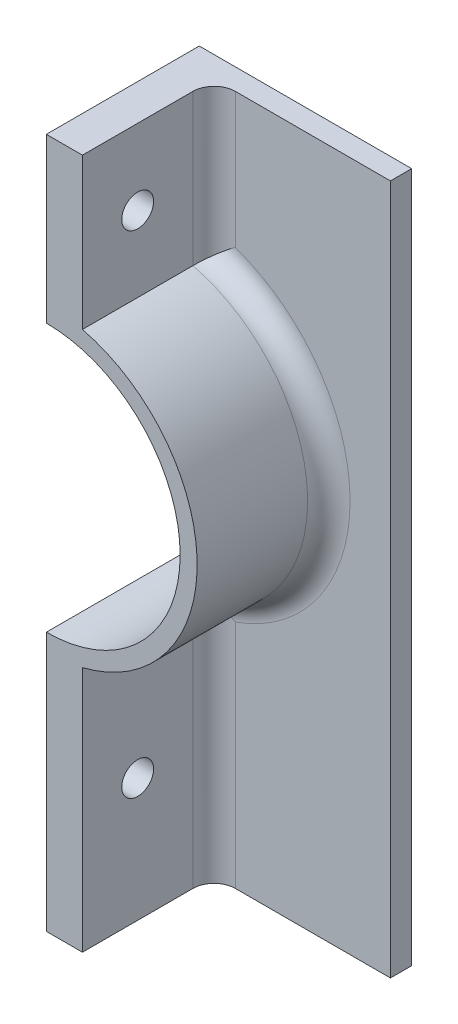
ISO-10303-21;
HEADER;
FILE_DESCRIPTION(('STEP AP214'),'2;1');
FILE_NAME('part.step','',(''),(''),'','','');
FILE_SCHEMA(('AUTOMOTIVE_DESIGN { 1 0 10303 214 1 1 1 1 }'));
ENDSEC;
DATA;
#1=APPLICATION_CONTEXT('core data for automotive mechanical design processes');
#2=APPLICATION_PROTOCOL_DEFINITION('international standard','automotive_design',2000,#1);
#3=PRODUCT_CONTEXT('',#1,'mechanical');
#4=PRODUCT('Part','Part','',(#3));
#5=PRODUCT_RELATED_PRODUCT_CATEGORY('part','',(#4));
#6=PRODUCT_DEFINITION_FORMATION('','',#4);
#7=PRODUCT_DEFINITION_CONTEXT('part definition',#1,'design');
#8=PRODUCT_DEFINITION('design','',#6,#7);
#9=PRODUCT_DEFINITION_SHAPE('','',#8);
#10=(LENGTH_UNIT() NAMED_UNIT(*) SI_UNIT(.MILLI.,.METRE.));
#11=(NAMED_UNIT(*) PLANE_ANGLE_UNIT() SI_UNIT($,.RADIAN.));
#12=(NAMED_UNIT(*) SI_UNIT($,.STERADIAN.) SOLID_ANGLE_UNIT());
#13=UNCERTAINTY_MEASURE_WITH_UNIT(LENGTH_MEASURE(1.E-05),#10,'distance_accuracy_value','');
#14=(GEOMETRIC_REPRESENTATION_CONTEXT(3) GLOBAL_UNCERTAINTY_ASSIGNED_CONTEXT((#13)) GLOBAL_UNIT_ASSIGNED_CONTEXT((#10,
#11,#12)) REPRESENTATION_CONTEXT('',''));
#15=CARTESIAN_POINT('',(0.,0.,0.));
#16=DIRECTION('',(0.,0.,1.));
#17=DIRECTION('',(1.,0.,0.));
#18=AXIS2_PLACEMENT_3D('',#15,#16,#17);
#19=CARTESIAN_POINT('',(29.718,0.,18.288));
#20=DIRECTION('',(-1.,0.,0.));
#21=DIRECTION('',(0.,0.,1.));
#22=AXIS2_PLACEMENT_3D('',#19,#20,#21);
#23=PLANE('',#22);
#24=CARTESIAN_POINT('',(29.718,14.740286526676,11.684));
#25=DIRECTION('',(-1.,0.,0.));
#26=DIRECTION('',(0.,0.,1.));
#27=AXIS2_PLACEMENT_3D('',#24,#25,#26);
#28=CIRCLE('',#27,1.905);
#29=CARTESIAN_POINT('',(29.718,14.740286526676,13.589));
#30=VERTEX_POINT('',#29);
#31=EDGE_CURVE('E253',#30,#30,#28,.F.);
#32=ORIENTED_EDGE('',*,*,#31,.F.);
#33=EDGE_LOOP('',(#32));
#34=FACE_BOUND('',#33,.T.);
#35=DIRECTION('',(0.,0.,-1.));
#36=VECTOR('',#35,1.);
#37=CARTESIAN_POINT('',(29.718,0.,18.288));
#38=LINE('',#37,#36);
#39=CARTESIAN_POINT('',(29.718,0.,18.288));
#40=VERTEX_POINT('',#39);
#41=CARTESIAN_POINT('',(29.718,0.,5.08));
#42=VERTEX_POINT('',#41);
#43=EDGE_CURVE('E210',#40,#42,#38,.T.);
#44=ORIENTED_EDGE('',*,*,#43,.T.);
#45=DIRECTION('',(0.,1.,0.));
#46=VECTOR('',#45,1.);
#47=CARTESIAN_POINT('',(29.718,0.,5.08));
#48=LINE('',#47,#46);
#49=CARTESIAN_POINT('',(29.718,29.4805730533521,5.08));
#50=VERTEX_POINT('',#49);
#51=EDGE_CURVE('E248',#42,#50,#48,.T.);
#52=ORIENTED_EDGE('',*,*,#51,.T.);
#53=DIRECTION('',(0.,0.,-1.));
#54=VECTOR('',#53,1.);
#55=CARTESIAN_POINT('',(29.718,29.4805730533521,18.288));
#56=LINE('',#55,#54);
#57=CARTESIAN_POINT('',(29.718,29.4805730533521,18.288));
#58=VERTEX_POINT('',#57);
#59=EDGE_CURVE('E245',#58,#50,#56,.T.);
#60=ORIENTED_EDGE('',*,*,#59,.F.);
#61=DIRECTION('',(0.,1.,0.));
#62=VECTOR('',#61,1.);
#63=CARTESIAN_POINT('',(29.718,0.,18.288));
#64=LINE('',#63,#62);
#65=EDGE_CURVE('E183',#40,#58,#64,.T.);
#66=ORIENTED_EDGE('',*,*,#65,.F.);
#67=EDGE_LOOP('',(#44,#52,#60,#66));
#68=FACE_BOUND('',#67,.T.);
#69=ADVANCED_FACE('F45',(#34,#68),#23,.F.);
#70=CARTESIAN_POINT('',(25.4,46.99,18.288));
#71=DIRECTION('',(0.,0.,-1.));
#72=DIRECTION('',(-1.,0.,0.));
#73=AXIS2_PLACEMENT_3D('',#70,#71,#72);
#74=CYLINDRICAL_SURFACE('',#73,18.034);
#75=ORIENTED_EDGE('',*,*,#59,.T.);
#76=CARTESIAN_POINT('',(25.4,46.99,5.08));
#77=DIRECTION('',(0.,0.,1.));
#78=DIRECTION('',(1.,0.,0.));
#79=AXIS2_PLACEMENT_3D('',#76,#77,#78);
#80=CIRCLE('',#79,18.034);
#81=CARTESIAN_POINT('',(29.718,64.4994269466479,5.08));
#82=VERTEX_POINT('',#81);
#83=EDGE_CURVE('E76',#50,#82,#80,.T.);
#84=ORIENTED_EDGE('',*,*,#83,.T.);
#85=DIRECTION('',(0.,0.,-1.));
#86=VECTOR('',#85,1.);
#87=CARTESIAN_POINT('',(29.718,64.4994269466479,18.288));
#88=LINE('',#87,#86);
#89=CARTESIAN_POINT('',(29.718,64.4994269466479,18.288));
#90=VERTEX_POINT('',#89);
#91=EDGE_CURVE('E242',#90,#82,#88,.T.);
#92=ORIENTED_EDGE('',*,*,#91,.F.);
#93=CARTESIAN_POINT('',(25.4,46.99,18.288));
#94=DIRECTION('',(0.,0.,1.));
#95=DIRECTION('',(1.,0.,0.));
#96=AXIS2_PLACEMENT_3D('',#93,#94,#95);
#97=CIRCLE('',#96,18.034);
#98=EDGE_CURVE('E187',#58,#90,#97,.T.);
#99=ORIENTED_EDGE('',*,*,#98,.F.);
#100=EDGE_LOOP('',(#75,#84,#92,#99));
#101=FACE_BOUND('',#100,.T.);
#102=ADVANCED_FACE('F298',(#101),#74,.T.);
#103=CARTESIAN_POINT('',(29.718,0.,18.288));
#104=DIRECTION('',(1.,0.,0.));
#105=DIRECTION('',(0.,0.,-1.));
#106=AXIS2_PLACEMENT_3D('',#103,#104,#105);
#107=PLANE('',#106);
#108=CARTESIAN_POINT('',(29.718,73.524713473324,11.684));
#109=DIRECTION('',(1.,0.,0.));
#110=DIRECTION('',(0.,0.,-1.));
#111=AXIS2_PLACEMENT_3D('',#108,#109,#110);
#112=CIRCLE('',#111,1.905);
#113=CARTESIAN_POINT('',(29.718,73.524713473324,9.779));
#114=VERTEX_POINT('',#113);
#115=EDGE_CURVE('E180',#114,#114,#112,.F.);
#116=ORIENTED_EDGE('',*,*,#115,.T.);
#117=EDGE_LOOP('',(#116));
#118=FACE_BOUND('',#117,.T.);
#119=ORIENTED_EDGE('',*,*,#91,.T.);
#120=DIRECTION('',(0.,-1.,0.));
#121=VECTOR('',#120,1.);
#122=CARTESIAN_POINT('',(29.718,82.55,5.08));
#123=LINE('',#122,#121);
#124=CARTESIAN_POINT('',(29.718,82.55,5.08));
#125=VERTEX_POINT('',#124);
#126=EDGE_CURVE('E68',#82,#125,#123,.F.);
#127=ORIENTED_EDGE('',*,*,#126,.T.);
#128=DIRECTION('',(0.,0.,-1.));
#129=VECTOR('',#128,1.);
#130=CARTESIAN_POINT('',(29.718,82.55,18.288));
#131=LINE('',#130,#129);
#132=CARTESIAN_POINT('',(29.718,82.55,18.288));
#133=VERTEX_POINT('',#132);
#134=EDGE_CURVE('E239',#133,#125,#131,.T.);
#135=ORIENTED_EDGE('',*,*,#134,.F.);
#136=DIRECTION('',(0.,-1.,0.));
#137=VECTOR('',#136,1.);
#138=CARTESIAN_POINT('',(29.718,0.,18.288));
#139=LINE('',#138,#137);
#140=EDGE_CURVE('E190',#133,#90,#139,.T.);
#141=ORIENTED_EDGE('',*,*,#140,.T.);
#142=EDGE_LOOP('',(#119,#127,#135,#141));
#143=FACE_BOUND('',#142,.T.);
#144=ADVANCED_FACE('F303',(#118,#143),#107,.T.);
#145=CARTESIAN_POINT('',(0.,82.55,18.288));
#146=DIRECTION('',(0.,1.,0.));
#147=DIRECTION('',(0.,0.,1.));
#148=AXIS2_PLACEMENT_3D('',#145,#146,#147);
#149=PLANE('',#148);
#150=DIRECTION('',(1.,0.,0.));
#151=VECTOR('',#150,1.);
#152=CARTESIAN_POINT('',(0.,82.55,0.));
#153=LINE('',#152,#151);
#154=CARTESIAN_POINT('',(25.4,82.55,0.));
#155=VERTEX_POINT('',#154);
#156=CARTESIAN_POINT('',(50.8,82.55,0.));
#157=VERTEX_POINT('',#156);
#158=EDGE_CURVE('E155',#155,#157,#153,.T.);
#159=ORIENTED_EDGE('',*,*,#158,.F.);
#160=DIRECTION('',(0.,0.,-1.));
#161=VECTOR('',#160,1.);
#162=CARTESIAN_POINT('',(25.4,82.55,18.288));
#163=LINE('',#162,#161);
#164=CARTESIAN_POINT('',(25.4,82.55,18.288));
#165=VERTEX_POINT('',#164);
#166=EDGE_CURVE('E236',#165,#155,#163,.T.);
#167=ORIENTED_EDGE('',*,*,#166,.F.);
#168=DIRECTION('',(1.,0.,0.));
#169=VECTOR('',#168,1.);
#170=CARTESIAN_POINT('',(0.,82.55,18.288));
#171=LINE('',#170,#169);
#172=EDGE_CURVE('E194',#165,#133,#171,.T.);
#173=ORIENTED_EDGE('',*,*,#172,.T.);
#174=ORIENTED_EDGE('',*,*,#134,.T.);
#175=CARTESIAN_POINT('',(32.258,82.55,5.08));
#176=DIRECTION('',(0.,1.,0.));
#177=DIRECTION('',(0.,0.,1.));
#178=AXIS2_PLACEMENT_3D('',#175,#176,#177);
#179=CIRCLE('',#178,2.54);
#180=CARTESIAN_POINT('',(32.258,82.55,2.54));
#181=VERTEX_POINT('',#180);
#182=EDGE_CURVE('E11',#125,#181,#179,.F.);
#183=ORIENTED_EDGE('',*,*,#182,.T.);
#184=DIRECTION('',(1.,0.,0.));
#185=VECTOR('',#184,1.);
#186=CARTESIAN_POINT('',(0.,82.55,2.54));
#187=LINE('',#186,#185);
#188=CARTESIAN_POINT('',(50.8,82.55,2.54));
#189=VERTEX_POINT('',#188);
#190=EDGE_CURVE('E172',#181,#189,#187,.T.);
#191=ORIENTED_EDGE('',*,*,#190,.T.);
#192=DIRECTION('',(0.,0.,-1.));
#193=VECTOR('',#192,1.);
#194=CARTESIAN_POINT('',(50.8,82.55,2.54));
#195=LINE('',#194,#193);
#196=EDGE_CURVE('E156',#189,#157,#195,.T.);
#197=ORIENTED_EDGE('',*,*,#196,.T.);
#198=EDGE_LOOP('',(#159,#167,#173,#174,#183,#191,#197));
#199=FACE_BOUND('',#198,.T.);
#200=ADVANCED_FACE('F310',(#199),#149,.T.);
#201=CARTESIAN_POINT('',(25.4,0.,18.288));
#202=DIRECTION('',(1.,0.,0.));
#203=DIRECTION('',(0.,0.,-1.));
#204=AXIS2_PLACEMENT_3D('',#201,#202,#203);
#205=PLANE('',#204);
#206=CARTESIAN_POINT('',(25.4,73.524713473324,11.684));
#207=DIRECTION('',(1.,0.,0.));
#208=DIRECTION('',(0.,0.,-1.));
#209=AXIS2_PLACEMENT_3D('',#206,#207,#208);
#210=CIRCLE('',#209,1.905);
#211=CARTESIAN_POINT('',(25.4,73.524713473324,9.779));
#212=VERTEX_POINT('',#211);
#213=EDGE_CURVE('E254',#212,#212,#210,.F.);
#214=ORIENTED_EDGE('',*,*,#213,.F.);
#215=EDGE_LOOP('',(#214));
#216=FACE_BOUND('',#215,.T.);
#217=DIRECTION('',(0.,-1.,0.));
#218=VECTOR('',#217,1.);
#219=CARTESIAN_POINT('',(25.4,0.,0.));
#220=LINE('',#219,#218);
#221=CARTESIAN_POINT('',(25.4,62.992,0.));
#222=VERTEX_POINT('',#221);
#223=EDGE_CURVE('E213',#155,#222,#220,.T.);
#224=ORIENTED_EDGE('',*,*,#223,.T.);
#225=DIRECTION('',(0.,0.,-1.));
#226=VECTOR('',#225,1.);
#227=CARTESIAN_POINT('',(25.4,62.992,18.288));
#228=LINE('',#227,#226);
#229=CARTESIAN_POINT('',(25.4,62.992,18.288));
#230=VERTEX_POINT('',#229);
#231=EDGE_CURVE('E233',#230,#222,#228,.T.);
#232=ORIENTED_EDGE('',*,*,#231,.F.);
#233=DIRECTION('',(0.,-1.,0.));
#234=VECTOR('',#233,1.);
#235=CARTESIAN_POINT('',(25.4,0.,18.288));
#236=LINE('',#235,#234);
#237=EDGE_CURVE('E198',#165,#230,#236,.T.);
#238=ORIENTED_EDGE('',*,*,#237,.F.);
#239=ORIENTED_EDGE('',*,*,#166,.T.);
#240=EDGE_LOOP('',(#224,#232,#238,#239));
#241=FACE_BOUND('',#240,.T.);
#242=ADVANCED_FACE('F314',(#216,#241),#205,.F.);
#243=CARTESIAN_POINT('',(25.4,46.99,18.288));
#244=DIRECTION('',(0.,0.,-1.));
#245=DIRECTION('',(-1.,0.,0.));
#246=AXIS2_PLACEMENT_3D('',#243,#244,#245);
#247=CYLINDRICAL_SURFACE('',#246,16.002);
#248=CARTESIAN_POINT('',(25.4,46.99,0.));
#249=DIRECTION('',(0.,0.,1.));
#250=DIRECTION('',(1.,0.,0.));
#251=AXIS2_PLACEMENT_3D('',#248,#249,#250);
#252=CIRCLE('',#251,16.002);
#253=CARTESIAN_POINT('',(25.4,30.988,0.));
#254=VERTEX_POINT('',#253);
#255=EDGE_CURVE('E217',#254,#222,#252,.T.);
#256=ORIENTED_EDGE('',*,*,#255,.F.);
#257=DIRECTION('',(0.,0.,-1.));
#258=VECTOR('',#257,1.);
#259=CARTESIAN_POINT('',(25.4,30.988,18.288));
#260=LINE('',#259,#258);
#261=CARTESIAN_POINT('',(25.4,30.988,18.288));
#262=VERTEX_POINT('',#261);
#263=EDGE_CURVE('E230',#262,#254,#260,.T.);
#264=ORIENTED_EDGE('',*,*,#263,.F.);
#265=CARTESIAN_POINT('',(25.4,46.99,18.288));
#266=DIRECTION('',(0.,0.,1.));
#267=DIRECTION('',(1.,0.,0.));
#268=AXIS2_PLACEMENT_3D('',#265,#266,#267);
#269=CIRCLE('',#268,16.002);
#270=EDGE_CURVE('E201',#262,#230,#269,.T.);
#271=ORIENTED_EDGE('',*,*,#270,.T.);
#272=ORIENTED_EDGE('',*,*,#231,.T.);
#273=EDGE_LOOP('',(#256,#264,#271,#272));
#274=FACE_BOUND('',#273,.T.);
#275=ADVANCED_FACE('F316',(#274),#247,.F.);
#276=CARTESIAN_POINT('',(25.4,14.740286526676,11.684));
#277=DIRECTION('',(1.,0.,0.));
#278=DIRECTION('',(0.,0.,-1.));
#279=AXIS2_PLACEMENT_3D('',#276,#277,#278);
#280=CIRCLE('',#279,1.905);
#281=CARTESIAN_POINT('',(25.4,14.740286526676,9.779));
#282=VERTEX_POINT('',#281);
#283=EDGE_CURVE('E249',#282,#282,#280,.F.);
#284=ORIENTED_EDGE('',*,*,#283,.F.);
#285=EDGE_LOOP('',(#284));
#286=FACE_BOUND('',#285,.T.);
#287=CARTESIAN_POINT('',(25.4,0.,0.));
#288=VERTEX_POINT('',#287);
#289=EDGE_CURVE('E218',#254,#288,#220,.T.);
#290=ORIENTED_EDGE('',*,*,#289,.T.);
#291=DIRECTION('',(0.,0.,-1.));
#292=VECTOR('',#291,1.);
#293=CARTESIAN_POINT('',(25.4,0.,18.288));
#294=LINE('',#293,#292);
#295=CARTESIAN_POINT('',(25.4,0.,18.288));
#296=VERTEX_POINT('',#295);
#297=EDGE_CURVE('E227',#296,#288,#294,.T.);
#298=ORIENTED_EDGE('',*,*,#297,.F.);
#299=EDGE_CURVE('E202',#262,#296,#236,.T.);
#300=ORIENTED_EDGE('',*,*,#299,.F.);
#301=ORIENTED_EDGE('',*,*,#263,.T.);
#302=EDGE_LOOP('',(#290,#298,#300,#301));
#303=FACE_BOUND('',#302,.T.);
#304=ADVANCED_FACE('F319',(#286,#303),#205,.F.);
#305=CARTESIAN_POINT('',(0.,0.,18.288));
#306=DIRECTION('',(0.,-1.,0.));
#307=DIRECTION('',(0.,0.,-1.));
#308=AXIS2_PLACEMENT_3D('',#305,#306,#307);
#309=PLANE('',#308);
#310=DIRECTION('',(-1.,0.,0.));
#311=VECTOR('',#310,1.);
#312=CARTESIAN_POINT('',(0.,0.,0.));
#313=LINE('',#312,#311);
#314=CARTESIAN_POINT('',(50.8,0.,0.));
#315=VERTEX_POINT('',#314);
#316=EDGE_CURVE('E149',#315,#288,#313,.T.);
#317=ORIENTED_EDGE('',*,*,#316,.F.);
#318=DIRECTION('',(0.,0.,-1.));
#319=VECTOR('',#318,1.);
#320=CARTESIAN_POINT('',(50.8,0.,2.54));
#321=LINE('',#320,#319);
#322=CARTESIAN_POINT('',(50.8,0.,2.54));
#323=VERTEX_POINT('',#322);
#324=EDGE_CURVE('E143',#323,#315,#321,.T.);
#325=ORIENTED_EDGE('',*,*,#324,.F.);
#326=DIRECTION('',(-1.,0.,0.));
#327=VECTOR('',#326,1.);
#328=CARTESIAN_POINT('',(0.,0.,2.54));
#329=LINE('',#328,#327);
#330=CARTESIAN_POINT('',(32.258,0.,2.54));
#331=VERTEX_POINT('',#330);
#332=EDGE_CURVE('E146',#323,#331,#329,.T.);
#333=ORIENTED_EDGE('',*,*,#332,.T.);
#334=CARTESIAN_POINT('',(32.258,0.,5.08));
#335=DIRECTION('',(0.,-1.,0.));
#336=DIRECTION('',(0.,0.,-1.));
#337=AXIS2_PLACEMENT_3D('',#334,#335,#336);
#338=CIRCLE('',#337,2.54);
#339=EDGE_CURVE('E60',#331,#42,#338,.F.);
#340=ORIENTED_EDGE('',*,*,#339,.T.);
#341=ORIENTED_EDGE('',*,*,#43,.F.);
#342=DIRECTION('',(-1.,0.,0.));
#343=VECTOR('',#342,1.);
#344=CARTESIAN_POINT('',(0.,0.,18.288));
#345=LINE('',#344,#343);
#346=EDGE_CURVE('E206',#40,#296,#345,.T.);
#347=ORIENTED_EDGE('',*,*,#346,.T.);
#348=ORIENTED_EDGE('',*,*,#297,.T.);
#349=EDGE_LOOP('',(#317,#325,#333,#340,#341,#347,#348));
#350=FACE_BOUND('',#349,.T.);
#351=ADVANCED_FACE('F145',(#350),#309,.T.);
#352=CARTESIAN_POINT('',(0.,0.,18.288));
#353=DIRECTION('',(0.,0.,1.));
#354=DIRECTION('',(1.,0.,0.));
#355=AXIS2_PLACEMENT_3D('',#352,#353,#354);
#356=PLANE('',#355);
#357=ORIENTED_EDGE('',*,*,#65,.T.);
#358=ORIENTED_EDGE('',*,*,#98,.T.);
#359=ORIENTED_EDGE('',*,*,#140,.F.);
#360=ORIENTED_EDGE('',*,*,#172,.F.);
#361=ORIENTED_EDGE('',*,*,#237,.T.);
#362=ORIENTED_EDGE('',*,*,#270,.F.);
#363=ORIENTED_EDGE('',*,*,#299,.T.);
#364=ORIENTED_EDGE('',*,*,#346,.F.);
#365=EDGE_LOOP('',(#357,#358,#359,#360,#361,#362,#363,#364));
#366=FACE_BOUND('',#365,.T.);
#367=ADVANCED_FACE('F326',(#366),#356,.T.);
#368=CARTESIAN_POINT('',(0.,0.,0.));
#369=DIRECTION('',(0.,0.,1.));
#370=DIRECTION('',(1.,0.,0.));
#371=AXIS2_PLACEMENT_3D('',#368,#369,#370);
#372=PLANE('',#371);
#373=DIRECTION('',(0.,-1.,0.));
#374=VECTOR('',#373,1.);
#375=CARTESIAN_POINT('',(50.8,0.,0.));
#376=LINE('',#375,#374);
#377=EDGE_CURVE('E166',#157,#315,#376,.T.);
#378=ORIENTED_EDGE('',*,*,#377,.T.);
#379=ORIENTED_EDGE('',*,*,#316,.T.);
#380=ORIENTED_EDGE('',*,*,#289,.F.);
#381=ORIENTED_EDGE('',*,*,#255,.T.);
#382=ORIENTED_EDGE('',*,*,#223,.F.);
#383=ORIENTED_EDGE('',*,*,#158,.T.);
#384=EDGE_LOOP('',(#378,#379,#380,#381,#382,#383));
#385=FACE_BOUND('',#384,.T.);
#386=ADVANCED_FACE('F327',(#385),#372,.F.);
#387=CARTESIAN_POINT('',(50.8,0.,2.54));
#388=DIRECTION('',(1.,0.,0.));
#389=DIRECTION('',(0.,0.,-1.));
#390=AXIS2_PLACEMENT_3D('',#387,#388,#389);
#391=PLANE('',#390);
#392=ORIENTED_EDGE('',*,*,#377,.F.);
#393=ORIENTED_EDGE('',*,*,#196,.F.);
#394=DIRECTION('',(0.,-1.,0.));
#395=VECTOR('',#394,1.);
#396=CARTESIAN_POINT('',(50.8,0.,2.54));
#397=LINE('',#396,#395);
#398=EDGE_CURVE('E162',#189,#323,#397,.T.);
#399=ORIENTED_EDGE('',*,*,#398,.T.);
#400=ORIENTED_EDGE('',*,*,#324,.T.);
#401=EDGE_LOOP('',(#392,#393,#399,#400));
#402=FACE_BOUND('',#401,.T.);
#403=ADVANCED_FACE('F169',(#402),#391,.T.);
#404=CARTESIAN_POINT('',(0.,0.,2.54));
#405=DIRECTION('',(0.,0.,1.));
#406=DIRECTION('',(1.,0.,0.));
#407=AXIS2_PLACEMENT_3D('',#404,#405,#406);
#408=PLANE('',#407);
#409=CARTESIAN_POINT('',(25.4,46.99,2.54));
#410=DIRECTION('',(0.,0.,1.));
#411=DIRECTION('',(1.,0.,0.));
#412=AXIS2_PLACEMENT_3D('',#409,#410,#411);
#413=CIRCLE('',#412,20.574);
#414=CARTESIAN_POINT('',(32.258,66.3873532215094,2.54));
#415=VERTEX_POINT('',#414);
#416=CARTESIAN_POINT('',(32.258,27.5926467784906,2.54));
#417=VERTEX_POINT('',#416);
#418=EDGE_CURVE('E264',#415,#417,#413,.F.);
#419=ORIENTED_EDGE('',*,*,#418,.T.);
#420=DIRECTION('',(0.,1.,0.));
#421=VECTOR('',#420,1.);
#422=CARTESIAN_POINT('',(32.258,0.,2.54));
#423=LINE('',#422,#421);
#424=EDGE_CURVE('E164',#417,#331,#423,.F.);
#425=ORIENTED_EDGE('',*,*,#424,.T.);
#426=ORIENTED_EDGE('',*,*,#332,.F.);
#427=ORIENTED_EDGE('',*,*,#398,.F.);
#428=ORIENTED_EDGE('',*,*,#190,.F.);
#429=DIRECTION('',(0.,-1.,0.));
#430=VECTOR('',#429,1.);
#431=CARTESIAN_POINT('',(32.258,64.4994269466479,2.54));
#432=LINE('',#431,#430);
#433=EDGE_CURVE('E261',#181,#415,#432,.T.);
#434=ORIENTED_EDGE('',*,*,#433,.T.);
#435=EDGE_LOOP('',(#419,#425,#426,#427,#428,#434));
#436=FACE_BOUND('',#435,.T.);
#437=ADVANCED_FACE('F160',(#436),#408,.T.);
#438=CARTESIAN_POINT('',(50.8,14.740286526676,11.684));
#439=DIRECTION('',(-1.,0.,0.));
#440=DIRECTION('',(0.,0.,1.));
#441=AXIS2_PLACEMENT_3D('',#438,#439,#440);
#442=CYLINDRICAL_SURFACE('',#441,1.905);
#443=ORIENTED_EDGE('',*,*,#283,.T.);
#444=EDGE_LOOP('',(#443));
#445=FACE_BOUND('',#444,.T.);
#446=ORIENTED_EDGE('',*,*,#31,.T.);
#447=EDGE_LOOP('',(#446));
#448=FACE_BOUND('',#447,.T.);
#449=ADVANCED_FACE('F338',(#445,#448),#442,.F.);
#450=CARTESIAN_POINT('',(50.8,73.524713473324,11.684));
#451=DIRECTION('',(-1.,0.,0.));
#452=DIRECTION('',(0.,0.,1.));
#453=AXIS2_PLACEMENT_3D('',#450,#451,#452);
#454=CYLINDRICAL_SURFACE('',#453,1.905);
#455=ORIENTED_EDGE('',*,*,#115,.F.);
#456=EDGE_LOOP('',(#455));
#457=FACE_BOUND('',#456,.T.);
#458=ORIENTED_EDGE('',*,*,#213,.T.);
#459=EDGE_LOOP('',(#458));
#460=FACE_BOUND('',#459,.T.);
#461=ADVANCED_FACE('F294',(#457,#460),#454,.F.);
#462=CARTESIAN_POINT('',(32.258,0.,5.08));
#463=DIRECTION('',(0.,1.,0.));
#464=DIRECTION('',(0.,0.,1.));
#465=AXIS2_PLACEMENT_3D('',#462,#463,#464);
#466=CYLINDRICAL_SURFACE('',#465,2.54);
#467=ORIENTED_EDGE('',*,*,#182,.F.);
#468=ORIENTED_EDGE('',*,*,#126,.F.);
#469=CARTESIAN_POINT('',(29.718,64.4994269466479,5.08));
#470=CARTESIAN_POINT('',(29.7179870755534,64.4994157868668,5.01902551348322));
#471=CARTESIAN_POINT('',(29.7201951885986,64.5011465240293,4.95805992742463));
#472=CARTESIAN_POINT('',(29.7289541236328,64.508006361398,4.83666739547746));
#473=CARTESIAN_POINT('',(29.7355024980739,64.513133546288,4.77624016545285));
#474=CARTESIAN_POINT('',(29.7527874036788,64.5266576853577,4.65675827025605));
#475=CARTESIAN_POINT('',(29.7634969105378,64.5350335405743,4.59769730252414));
#476=CARTESIAN_POINT('',(29.7889195344425,64.5548966763871,4.48098947118643));
#477=CARTESIAN_POINT('',(29.8036330200888,64.5663842434425,4.42334273830592));
#478=CARTESIAN_POINT('',(29.8533973376784,64.6051901368569,4.25333605531588));
#479=CARTESIAN_POINT('',(29.8941236579594,64.6368922369605,4.14356420590233));
#480=CARTESIAN_POINT('',(29.988626935846,64.7101920725611,3.93331311585028));
#481=CARTESIAN_POINT('',(30.0424234212943,64.7518046131729,3.83284809350339));
#482=CARTESIAN_POINT('',(30.1655358747617,64.8466304258917,3.63507801502231));
#483=CARTESIAN_POINT('',(30.2357399147279,64.9004988597566,3.53864359460705));
#484=CARTESIAN_POINT('',(30.3862683397798,65.0154063730678,3.3589603077969));
#485=CARTESIAN_POINT('',(30.4665947442465,65.0764468831567,3.275714079907));
#486=CARTESIAN_POINT('',(30.6525583713823,65.2169776965002,3.10693595357619));
#487=CARTESIAN_POINT('',(30.7600115098867,65.297687496294,3.02442169966884));
#488=CARTESIAN_POINT('',(30.9836384340724,65.4644689736679,2.87876314977381));
#489=CARTESIAN_POINT('',(31.0998228806023,65.5505471834883,2.81564302827231));
#490=CARTESIAN_POINT('',(31.3620316839482,65.7434034027618,2.69811570634428));
#491=CARTESIAN_POINT('',(31.5094088340701,65.8509048541518,2.64790950507683));
#492=CARTESIAN_POINT('',(31.8092299008624,66.067693164032,2.57521636921352));
#493=CARTESIAN_POINT('',(31.9616646544673,66.1769766288619,2.55268184558765));
#494=CARTESIAN_POINT('',(32.1597134083756,66.3177556544249,2.54150524908516));
#495=CARTESIAN_POINT('',(32.2045984735808,66.3495819070552,2.54016401882533));
#496=CARTESIAN_POINT('',(32.252349485532,66.3833573949703,2.54000471614421));
#497=CARTESIAN_POINT('',(32.2551746652366,66.3853554072994,2.54000000228932));
#498=CARTESIAN_POINT('',(32.258,66.3873532215094,2.54));
#499=B_SPLINE_CURVE_WITH_KNOTS('',3,(#469,#470,#471,#472,#473,#474,#475,#476,#477,#478,#479,
#480,#481,#482,#483,#484,#485,#486,#487,#488,#489,#490,#491,#492,#493,#494,#495,#496,#497,#498),
.UNSPECIFIED.,.F.,.F.,(4,2,2,2,2,2,2,2,2,2,2,2,2,2,4),(0.,0.182844331911326,0.365585642388308,
0.547159466912742,0.728750012516879,1.0908900357854,1.45357448817017,1.84479641774465,
2.23609651883415,2.70746288858523,3.17941444770126,3.74483032909133,4.30927245496242,
4.47435907852635,4.48473998763802),.UNSPECIFIED.);
#500=EDGE_CURVE('E50',#415,#82,#499,.F.);
#501=ORIENTED_EDGE('',*,*,#500,.F.);
#502=ORIENTED_EDGE('',*,*,#433,.F.);
#503=EDGE_LOOP('',(#467,#468,#501,#502));
#504=FACE_BOUND('',#503,.T.);
#505=ADVANCED_FACE('F47',(#504),#466,.F.);
#506=CARTESIAN_POINT('',(25.4,46.99,5.08));
#507=DIRECTION('',(0.,0.,1.));
#508=DIRECTION('',(1.,0.,0.));
#509=AXIS2_PLACEMENT_3D('',#506,#507,#508);
#510=TOROIDAL_SURFACE('',#509,20.574,2.54);
#511=ORIENTED_EDGE('',*,*,#500,.T.);
#512=ORIENTED_EDGE('',*,*,#83,.F.);
#513=CARTESIAN_POINT('',(29.718,29.4805730533521,5.08));
#514=CARTESIAN_POINT('',(29.7179870755534,29.4805842131332,5.01902551348322));
#515=CARTESIAN_POINT('',(29.7201951885986,29.4788534759707,4.95805992742463));
#516=CARTESIAN_POINT('',(29.7289541236328,29.471993638602,4.83666739547745));
#517=CARTESIAN_POINT('',(29.7355024980739,29.466866453712,4.77624016545285));
#518=CARTESIAN_POINT('',(29.7527874036788,29.4533423146423,4.65675827025604));
#519=CARTESIAN_POINT('',(29.7634969105378,29.4449664594257,4.59769730252414));
#520=CARTESIAN_POINT('',(29.7889195344425,29.4251033236129,4.48098947118643));
#521=CARTESIAN_POINT('',(29.8036330200888,29.4136157565575,4.42334273830592));
#522=CARTESIAN_POINT('',(29.8533973376784,29.3748098631431,4.25333605531588));
#523=CARTESIAN_POINT('',(29.8941236579594,29.3431077630395,4.14356420590233));
#524=CARTESIAN_POINT('',(29.988626935846,29.2698079274389,3.93331311585028));
#525=CARTESIAN_POINT('',(30.0424234212943,29.2281953868271,3.83284809350339));
#526=CARTESIAN_POINT('',(30.1655358747617,29.1333695741083,3.63507801502231));
#527=CARTESIAN_POINT('',(30.2357399147279,29.0795011402434,3.53864359460705));
#528=CARTESIAN_POINT('',(30.3862683397798,28.9645936269322,3.3589603077969));
#529=CARTESIAN_POINT('',(30.4665947442465,28.9035531168433,3.275714079907));
#530=CARTESIAN_POINT('',(30.6525583713823,28.7630223034998,3.10693595357619));
#531=CARTESIAN_POINT('',(30.7600115098867,28.6823125037061,3.02442169966884));
#532=CARTESIAN_POINT('',(30.9836384340723,28.5155310263321,2.87876314977381));
#533=CARTESIAN_POINT('',(31.0998228806022,28.4294528165116,2.81564302827231));
#534=CARTESIAN_POINT('',(31.3620316839482,28.2365965972383,2.69811570634427));
#535=CARTESIAN_POINT('',(31.5094088340704,28.1290951458486,2.64790950507683));
#536=CARTESIAN_POINT('',(31.8092299008621,27.9123068359675,2.57521636921351));
#537=CARTESIAN_POINT('',(31.9616646544662,27.8030233711365,2.55268184558765));
#538=CARTESIAN_POINT('',(32.1597134083759,27.6622443455756,2.54150524908516));
#539=CARTESIAN_POINT('',(32.2045984735816,27.630418092946,2.54016401882533));
#540=CARTESIAN_POINT('',(32.2523494855321,27.5966426050299,2.54000471614421));
#541=CARTESIAN_POINT('',(32.2551746652366,27.5946445927007,2.54000000228933));
#542=CARTESIAN_POINT('',(32.258,27.5926467784906,2.54));
#543=B_SPLINE_CURVE_WITH_KNOTS('',3,(#513,#514,#515,#516,#517,#518,#519,#520,#521,#522,#523,
#524,#525,#526,#527,#528,#529,#530,#531,#532,#533,#534,#535,#536,#537,#538,#539,#540,#541,#542),
.UNSPECIFIED.,.F.,.F.,(4,2,2,2,2,2,2,2,2,2,2,2,2,2,4),(0.,0.182844331911327,0.36558564238831,
0.547159466912742,0.72875001251688,1.09089003578539,1.45357448817016,1.84479641774466,
2.23609651883415,2.70746288858522,3.17941444770127,3.74483032909137,4.30927245496242,
4.47435907852634,4.48473998763801),.UNSPECIFIED.);
#544=EDGE_CURVE('E274',#417,#50,#543,.F.);
#545=ORIENTED_EDGE('',*,*,#544,.F.);
#546=ORIENTED_EDGE('',*,*,#418,.F.);
#547=EDGE_LOOP('',(#511,#512,#545,#546));
#548=FACE_BOUND('',#547,.T.);
#549=ADVANCED_FACE('F284',(#548),#510,.F.);
#550=CARTESIAN_POINT('',(32.258,0.,5.08));
#551=DIRECTION('',(0.,1.,0.));
#552=DIRECTION('',(0.,0.,1.));
#553=AXIS2_PLACEMENT_3D('',#550,#551,#552);
#554=CYLINDRICAL_SURFACE('',#553,2.54);
#555=ORIENTED_EDGE('',*,*,#339,.F.);
#556=ORIENTED_EDGE('',*,*,#424,.F.);
#557=ORIENTED_EDGE('',*,*,#544,.T.);
#558=ORIENTED_EDGE('',*,*,#51,.F.);
#559=EDGE_LOOP('',(#555,#556,#557,#558));
#560=FACE_BOUND('',#559,.T.);
#561=ADVANCED_FACE('F281',(#560),#554,.F.);
#562=CLOSED_SHELL('',(#69,#102,#144,#200,#242,#275,#304,#351,#367,#386,#403,#437,#449,#461,#505,
#549,#561));
#563=MANIFOLD_SOLID_BREP('B2',#562);
#564=ADVANCED_BREP_SHAPE_REPRESENTATION('',(#18,#563),#14);
#565=SHAPE_DEFINITION_REPRESENTATION(#9,#564);
ENDSEC;
END-ISO-10303-21;
